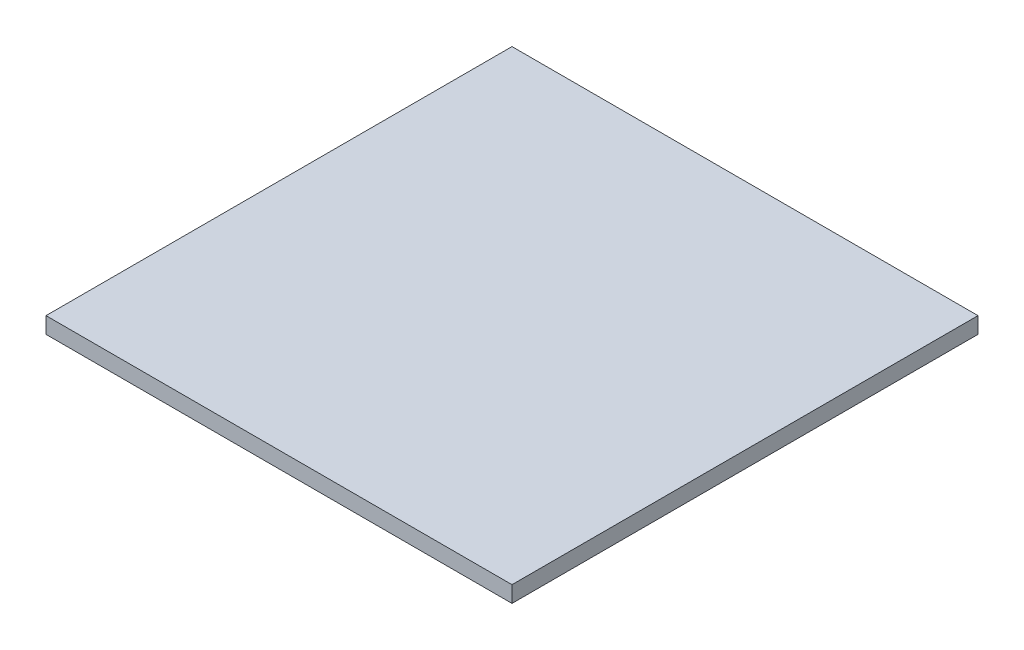
ISO-10303-21;
HEADER;
FILE_DESCRIPTION(('STEP AP214'),'2;1');
FILE_NAME('part.step','',(''),(''),'','','');
FILE_SCHEMA(('AUTOMOTIVE_DESIGN { 1 0 10303 214 1 1 1 1 }'));
ENDSEC;
DATA;
#1=APPLICATION_CONTEXT('core data for automotive mechanical design processes');
#2=APPLICATION_PROTOCOL_DEFINITION('international standard','automotive_design',2000,#1);
#3=PRODUCT_CONTEXT('',#1,'mechanical');
#4=PRODUCT('Part','Part','',(#3));
#5=PRODUCT_RELATED_PRODUCT_CATEGORY('part','',(#4));
#6=PRODUCT_DEFINITION_FORMATION('','',#4);
#7=PRODUCT_DEFINITION_CONTEXT('part definition',#1,'design');
#8=PRODUCT_DEFINITION('design','',#6,#7);
#9=PRODUCT_DEFINITION_SHAPE('','',#8);
#10=(LENGTH_UNIT() NAMED_UNIT(*) SI_UNIT(.MILLI.,.METRE.));
#11=(NAMED_UNIT(*) PLANE_ANGLE_UNIT() SI_UNIT($,.RADIAN.));
#12=(NAMED_UNIT(*) SI_UNIT($,.STERADIAN.) SOLID_ANGLE_UNIT());
#13=UNCERTAINTY_MEASURE_WITH_UNIT(LENGTH_MEASURE(1.E-05),#10,'distance_accuracy_value','');
#14=(GEOMETRIC_REPRESENTATION_CONTEXT(3) GLOBAL_UNCERTAINTY_ASSIGNED_CONTEXT((#13)) GLOBAL_UNIT_ASSIGNED_CONTEXT((#10,
#11,#12)) REPRESENTATION_CONTEXT('',''));
#15=CARTESIAN_POINT('',(0.,0.,0.));
#16=DIRECTION('',(0.,0.,1.));
#17=DIRECTION('',(1.,0.,0.));
#18=AXIS2_PLACEMENT_3D('',#15,#16,#17);
#19=CARTESIAN_POINT('',(17.5,1.22,17.5));
#20=DIRECTION('',(-1.,0.,0.));
#21=DIRECTION('',(0.,0.,1.));
#22=AXIS2_PLACEMENT_3D('',#19,#20,#21);
#23=PLANE('',#22);
#24=DIRECTION('',(0.,0.,-1.));
#25=VECTOR('',#24,1.);
#26=CARTESIAN_POINT('',(17.5,0.,17.5));
#27=LINE('',#26,#25);
#28=CARTESIAN_POINT('',(17.5,0.,17.5));
#29=VERTEX_POINT('',#28);
#30=CARTESIAN_POINT('',(17.5,0.,-17.5));
#31=VERTEX_POINT('',#30);
#32=EDGE_CURVE('E97',#29,#31,#27,.T.);
#33=ORIENTED_EDGE('',*,*,#32,.T.);
#34=DIRECTION('',(0.,-1.,0.));
#35=VECTOR('',#34,1.);
#36=CARTESIAN_POINT('',(17.5,1.22,-17.5));
#37=LINE('',#36,#35);
#38=CARTESIAN_POINT('',(17.5,1.22,-17.5));
#39=VERTEX_POINT('',#38);
#40=EDGE_CURVE('E11',#39,#31,#37,.T.);
#41=ORIENTED_EDGE('',*,*,#40,.F.);
#42=DIRECTION('',(0.,0.,-1.));
#43=VECTOR('',#42,1.);
#44=CARTESIAN_POINT('',(17.5,1.22,17.5));
#45=LINE('',#44,#43);
#46=CARTESIAN_POINT('',(17.5,1.22,17.5));
#47=VERTEX_POINT('',#46);
#48=EDGE_CURVE('E85',#47,#39,#45,.T.);
#49=ORIENTED_EDGE('',*,*,#48,.F.);
#50=DIRECTION('',(0.,-1.,0.));
#51=VECTOR('',#50,1.);
#52=CARTESIAN_POINT('',(17.5,1.22,17.5));
#53=LINE('',#52,#51);
#54=EDGE_CURVE('E93',#47,#29,#53,.T.);
#55=ORIENTED_EDGE('',*,*,#54,.T.);
#56=EDGE_LOOP('',(#33,#41,#49,#55));
#57=FACE_BOUND('',#56,.T.);
#58=ADVANCED_FACE('F34',(#57),#23,.F.);
#59=CARTESIAN_POINT('',(-17.5,1.22,-17.5));
#60=DIRECTION('',(0.,0.,1.));
#61=DIRECTION('',(1.,0.,0.));
#62=AXIS2_PLACEMENT_3D('',#59,#60,#61);
#63=PLANE('',#62);
#64=DIRECTION('',(-1.,0.,0.));
#65=VECTOR('',#64,1.);
#66=CARTESIAN_POINT('',(-17.5,0.,-17.5));
#67=LINE('',#66,#65);
#68=CARTESIAN_POINT('',(-17.5,0.,-17.5));
#69=VERTEX_POINT('',#68);
#70=EDGE_CURVE('E89',#31,#69,#67,.T.);
#71=ORIENTED_EDGE('',*,*,#70,.T.);
#72=DIRECTION('',(0.,-1.,0.));
#73=VECTOR('',#72,1.);
#74=CARTESIAN_POINT('',(-17.5,1.22,-17.5));
#75=LINE('',#74,#73);
#76=CARTESIAN_POINT('',(-17.5,1.22,-17.5));
#77=VERTEX_POINT('',#76);
#78=EDGE_CURVE('E42',#77,#69,#75,.T.);
#79=ORIENTED_EDGE('',*,*,#78,.F.);
#80=DIRECTION('',(-1.,0.,0.));
#81=VECTOR('',#80,1.);
#82=CARTESIAN_POINT('',(-17.5,1.22,-17.5));
#83=LINE('',#82,#81);
#84=EDGE_CURVE('E80',#39,#77,#83,.T.);
#85=ORIENTED_EDGE('',*,*,#84,.F.);
#86=ORIENTED_EDGE('',*,*,#40,.T.);
#87=EDGE_LOOP('',(#71,#79,#85,#86));
#88=FACE_BOUND('',#87,.T.);
#89=ADVANCED_FACE('F88',(#88),#63,.F.);
#90=CARTESIAN_POINT('',(-17.5,1.22,17.5));
#91=DIRECTION('',(1.,0.,0.));
#92=DIRECTION('',(0.,0.,-1.));
#93=AXIS2_PLACEMENT_3D('',#90,#91,#92);
#94=PLANE('',#93);
#95=DIRECTION('',(0.,0.,1.));
#96=VECTOR('',#95,1.);
#97=CARTESIAN_POINT('',(-17.5,0.,17.5));
#98=LINE('',#97,#96);
#99=CARTESIAN_POINT('',(-17.5,0.,17.5));
#100=VERTEX_POINT('',#99);
#101=EDGE_CURVE('E67',#69,#100,#98,.T.);
#102=ORIENTED_EDGE('',*,*,#101,.T.);
#103=DIRECTION('',(0.,-1.,0.));
#104=VECTOR('',#103,1.);
#105=CARTESIAN_POINT('',(-17.5,1.22,17.5));
#106=LINE('',#105,#104);
#107=CARTESIAN_POINT('',(-17.5,1.22,17.5));
#108=VERTEX_POINT('',#107);
#109=EDGE_CURVE('E90',#108,#100,#106,.T.);
#110=ORIENTED_EDGE('',*,*,#109,.F.);
#111=DIRECTION('',(0.,0.,1.));
#112=VECTOR('',#111,1.);
#113=CARTESIAN_POINT('',(-17.5,1.22,17.5));
#114=LINE('',#113,#112);
#115=EDGE_CURVE('E83',#77,#108,#114,.T.);
#116=ORIENTED_EDGE('',*,*,#115,.F.);
#117=ORIENTED_EDGE('',*,*,#78,.T.);
#118=EDGE_LOOP('',(#102,#110,#116,#117));
#119=FACE_BOUND('',#118,.T.);
#120=ADVANCED_FACE('F91',(#119),#94,.F.);
#121=CARTESIAN_POINT('',(-17.5,1.22,17.5));
#122=DIRECTION('',(0.,0.,-1.));
#123=DIRECTION('',(-1.,0.,0.));
#124=AXIS2_PLACEMENT_3D('',#121,#122,#123);
#125=PLANE('',#124);
#126=DIRECTION('',(1.,0.,0.));
#127=VECTOR('',#126,1.);
#128=CARTESIAN_POINT('',(-17.5,0.,17.5));
#129=LINE('',#128,#127);
#130=EDGE_CURVE('E73',#100,#29,#129,.T.);
#131=ORIENTED_EDGE('',*,*,#130,.T.);
#132=ORIENTED_EDGE('',*,*,#54,.F.);
#133=DIRECTION('',(1.,0.,0.));
#134=VECTOR('',#133,1.);
#135=CARTESIAN_POINT('',(-17.5,1.22,17.5));
#136=LINE('',#135,#134);
#137=EDGE_CURVE('E50',#108,#47,#136,.T.);
#138=ORIENTED_EDGE('',*,*,#137,.F.);
#139=ORIENTED_EDGE('',*,*,#109,.T.);
#140=EDGE_LOOP('',(#131,#132,#138,#139));
#141=FACE_BOUND('',#140,.T.);
#142=ADVANCED_FACE('F104',(#141),#125,.F.);
#143=CARTESIAN_POINT('',(0.,1.22,0.));
#144=DIRECTION('',(0.,-1.,0.));
#145=DIRECTION('',(0.,0.,-1.));
#146=AXIS2_PLACEMENT_3D('',#143,#144,#145);
#147=PLANE('',#146);
#148=ORIENTED_EDGE('',*,*,#48,.T.);
#149=ORIENTED_EDGE('',*,*,#84,.T.);
#150=ORIENTED_EDGE('',*,*,#115,.T.);
#151=ORIENTED_EDGE('',*,*,#137,.T.);
#152=EDGE_LOOP('',(#148,#149,#150,#151));
#153=FACE_BOUND('',#152,.T.);
#154=ADVANCED_FACE('F81',(#153),#147,.F.);
#155=CARTESIAN_POINT('',(0.,0.,0.));
#156=DIRECTION('',(0.,-1.,0.));
#157=DIRECTION('',(0.,0.,-1.));
#158=AXIS2_PLACEMENT_3D('',#155,#156,#157);
#159=PLANE('',#158);
#160=ORIENTED_EDGE('',*,*,#32,.F.);
#161=ORIENTED_EDGE('',*,*,#130,.F.);
#162=ORIENTED_EDGE('',*,*,#101,.F.);
#163=ORIENTED_EDGE('',*,*,#70,.F.);
#164=EDGE_LOOP('',(#160,#161,#162,#163));
#165=FACE_BOUND('',#164,.T.);
#166=ADVANCED_FACE('F107',(#165),#159,.T.);
#167=CLOSED_SHELL('',(#58,#89,#120,#142,#154,#166));
#168=MANIFOLD_SOLID_BREP('B2',#167);
#169=ADVANCED_BREP_SHAPE_REPRESENTATION('',(#18,#168),#14);
#170=SHAPE_DEFINITION_REPRESENTATION(#9,#169);
ENDSEC;
END-ISO-10303-21;
